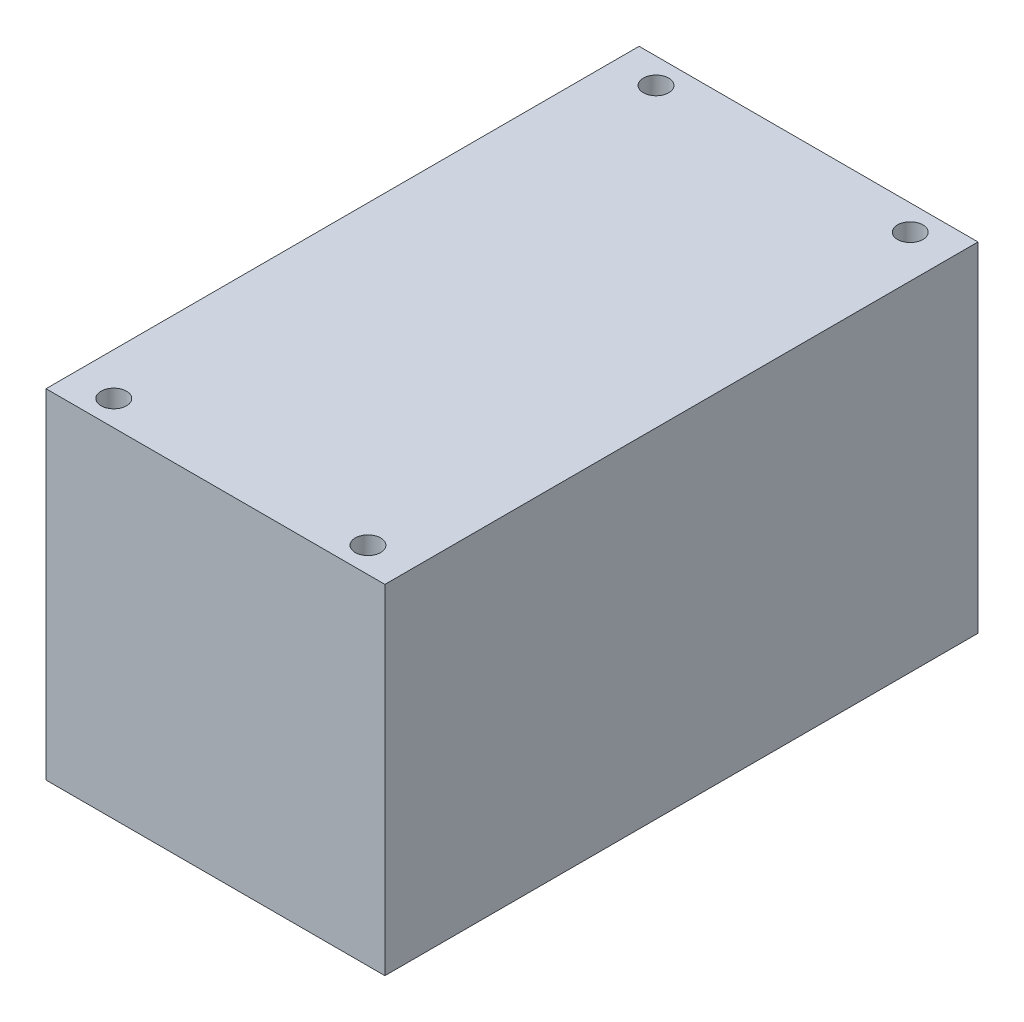
ISO-10303-21;
HEADER;
FILE_DESCRIPTION(('STEP AP214'),'2;1');
FILE_NAME('part.step','',(''),(''),'','','');
FILE_SCHEMA(('AUTOMOTIVE_DESIGN { 1 0 10303 214 1 1 1 1 }'));
ENDSEC;
DATA;
#1=APPLICATION_CONTEXT('core data for automotive mechanical design processes');
#2=APPLICATION_PROTOCOL_DEFINITION('international standard','automotive_design',2000,#1);
#3=PRODUCT_CONTEXT('',#1,'mechanical');
#4=PRODUCT('Part','Part','',(#3));
#5=PRODUCT_RELATED_PRODUCT_CATEGORY('part','',(#4));
#6=PRODUCT_DEFINITION_FORMATION('','',#4);
#7=PRODUCT_DEFINITION_CONTEXT('part definition',#1,'design');
#8=PRODUCT_DEFINITION('design','',#6,#7);
#9=PRODUCT_DEFINITION_SHAPE('','',#8);
#10=(LENGTH_UNIT() NAMED_UNIT(*) SI_UNIT(.MILLI.,.METRE.));
#11=(NAMED_UNIT(*) PLANE_ANGLE_UNIT() SI_UNIT($,.RADIAN.));
#12=(NAMED_UNIT(*) SI_UNIT($,.STERADIAN.) SOLID_ANGLE_UNIT());
#13=UNCERTAINTY_MEASURE_WITH_UNIT(LENGTH_MEASURE(1.E-05),#10,'distance_accuracy_value','');
#14=(GEOMETRIC_REPRESENTATION_CONTEXT(3) GLOBAL_UNCERTAINTY_ASSIGNED_CONTEXT((#13)) GLOBAL_UNIT_ASSIGNED_CONTEXT((#10,
#11,#12)) REPRESENTATION_CONTEXT('',''));
#15=CARTESIAN_POINT('',(0.,0.,0.));
#16=DIRECTION('',(0.,0.,1.));
#17=DIRECTION('',(1.,0.,0.));
#18=AXIS2_PLACEMENT_3D('',#15,#16,#17);
#19=CARTESIAN_POINT('',(-20.,-20.,-70.));
#20=DIRECTION('',(0.,-1.,0.));
#21=DIRECTION('',(0.,0.,-1.));
#22=AXIS2_PLACEMENT_3D('',#19,#20,#21);
#23=PLANE('',#22);
#24=CARTESIAN_POINT('',(-15.,-20.,-67.));
#25=DIRECTION('',(0.,1.,0.));
#26=DIRECTION('',(0.,0.,1.));
#27=AXIS2_PLACEMENT_3D('',#24,#25,#26);
#28=CIRCLE('',#27,1.49999999999999);
#29=CARTESIAN_POINT('',(-15.,-20.,-65.5));
#30=VERTEX_POINT('',#29);
#31=EDGE_CURVE('E138',#30,#30,#28,.T.);
#32=ORIENTED_EDGE('',*,*,#31,.T.);
#33=EDGE_LOOP('',(#32));
#34=FACE_BOUND('',#33,.T.);
#35=CARTESIAN_POINT('',(15.,-20.,-67.));
#36=DIRECTION('',(0.,1.,0.));
#37=DIRECTION('',(0.,0.,1.));
#38=AXIS2_PLACEMENT_3D('',#35,#36,#37);
#39=CIRCLE('',#38,1.49999999999999);
#40=CARTESIAN_POINT('',(15.,-20.,-65.5));
#41=VERTEX_POINT('',#40);
#42=EDGE_CURVE('E130',#41,#41,#39,.T.);
#43=ORIENTED_EDGE('',*,*,#42,.T.);
#44=EDGE_LOOP('',(#43));
#45=FACE_BOUND('',#44,.T.);
#46=DIRECTION('',(1.,0.,0.));
#47=VECTOR('',#46,1.);
#48=CARTESIAN_POINT('',(-20.,-20.,0.));
#49=LINE('',#48,#47);
#50=CARTESIAN_POINT('',(-20.,-20.,0.));
#51=VERTEX_POINT('',#50);
#52=CARTESIAN_POINT('',(20.,-20.,0.));
#53=VERTEX_POINT('',#52);
#54=EDGE_CURVE('E97',#51,#53,#49,.T.);
#55=ORIENTED_EDGE('',*,*,#54,.F.);
#56=DIRECTION('',(0.,0.,1.));
#57=VECTOR('',#56,1.);
#58=CARTESIAN_POINT('',(-20.,-20.,-70.));
#59=LINE('',#58,#57);
#60=CARTESIAN_POINT('',(-20.,-20.,-70.));
#61=VERTEX_POINT('',#60);
#62=EDGE_CURVE('E46',#61,#51,#59,.T.);
#63=ORIENTED_EDGE('',*,*,#62,.F.);
#64=DIRECTION('',(1.,0.,0.));
#65=VECTOR('',#64,1.);
#66=CARTESIAN_POINT('',(-20.,-20.,-70.));
#67=LINE('',#66,#65);
#68=CARTESIAN_POINT('',(20.,-20.,-70.));
#69=VERTEX_POINT('',#68);
#70=EDGE_CURVE('E92',#61,#69,#67,.T.);
#71=ORIENTED_EDGE('',*,*,#70,.T.);
#72=DIRECTION('',(0.,0.,1.));
#73=VECTOR('',#72,1.);
#74=CARTESIAN_POINT('',(20.,-20.,-70.));
#75=LINE('',#74,#73);
#76=EDGE_CURVE('E11',#69,#53,#75,.T.);
#77=ORIENTED_EDGE('',*,*,#76,.T.);
#78=EDGE_LOOP('',(#55,#63,#71,#77));
#79=FACE_BOUND('',#78,.T.);
#80=CARTESIAN_POINT('',(15.,-20.,-3.00000000000002));
#81=DIRECTION('',(0.,1.,0.));
#82=DIRECTION('',(0.,0.,1.));
#83=AXIS2_PLACEMENT_3D('',#80,#81,#82);
#84=CIRCLE('',#83,1.49999999999999);
#85=CARTESIAN_POINT('',(15.,-20.,-1.50000000000002));
#86=VERTEX_POINT('',#85);
#87=EDGE_CURVE('E106',#86,#86,#84,.T.);
#88=ORIENTED_EDGE('',*,*,#87,.T.);
#89=EDGE_LOOP('',(#88));
#90=FACE_BOUND('',#89,.T.);
#91=CARTESIAN_POINT('',(-15.,-20.,-3.00000000000002));
#92=DIRECTION('',(0.,1.,0.));
#93=DIRECTION('',(0.,0.,1.));
#94=AXIS2_PLACEMENT_3D('',#91,#92,#93);
#95=CIRCLE('',#94,1.49999999999999);
#96=CARTESIAN_POINT('',(-15.,-20.,-1.50000000000003));
#97=VERTEX_POINT('',#96);
#98=EDGE_CURVE('E122',#97,#97,#95,.T.);
#99=ORIENTED_EDGE('',*,*,#98,.T.);
#100=EDGE_LOOP('',(#99));
#101=FACE_BOUND('',#100,.T.);
#102=ADVANCED_FACE('F36',(#34,#45,#79,#90,#101),#23,.T.);
#103=CARTESIAN_POINT('',(20.,20.,-70.));
#104=DIRECTION('',(1.,0.,0.));
#105=DIRECTION('',(0.,1.,0.));
#106=AXIS2_PLACEMENT_3D('',#103,#104,#105);
#107=PLANE('',#106);
#108=DIRECTION('',(0.,1.,0.));
#109=VECTOR('',#108,1.);
#110=CARTESIAN_POINT('',(20.,20.,0.));
#111=LINE('',#110,#109);
#112=CARTESIAN_POINT('',(20.,20.,0.));
#113=VERTEX_POINT('',#112);
#114=EDGE_CURVE('E102',#53,#113,#111,.T.);
#115=ORIENTED_EDGE('',*,*,#114,.F.);
#116=ORIENTED_EDGE('',*,*,#76,.F.);
#117=DIRECTION('',(0.,1.,0.));
#118=VECTOR('',#117,1.);
#119=CARTESIAN_POINT('',(20.,20.,-70.));
#120=LINE('',#119,#118);
#121=CARTESIAN_POINT('',(20.,20.,-70.));
#122=VERTEX_POINT('',#121);
#123=EDGE_CURVE('E95',#69,#122,#120,.T.);
#124=ORIENTED_EDGE('',*,*,#123,.T.);
#125=DIRECTION('',(0.,0.,1.));
#126=VECTOR('',#125,1.);
#127=CARTESIAN_POINT('',(20.,20.,-70.));
#128=LINE('',#127,#126);
#129=EDGE_CURVE('E40',#122,#113,#128,.T.);
#130=ORIENTED_EDGE('',*,*,#129,.T.);
#131=EDGE_LOOP('',(#115,#116,#124,#130));
#132=FACE_BOUND('',#131,.T.);
#133=ADVANCED_FACE('F38',(#132),#107,.T.);
#134=CARTESIAN_POINT('',(-20.,20.,-70.));
#135=DIRECTION('',(-1.,0.,0.));
#136=DIRECTION('',(0.,-1.,0.));
#137=AXIS2_PLACEMENT_3D('',#134,#135,#136);
#138=PLANE('',#137);
#139=DIRECTION('',(0.,-1.,0.));
#140=VECTOR('',#139,1.);
#141=CARTESIAN_POINT('',(-20.,20.,0.));
#142=LINE('',#141,#140);
#143=CARTESIAN_POINT('',(-20.,20.,0.));
#144=VERTEX_POINT('',#143);
#145=EDGE_CURVE('E87',#144,#51,#142,.T.);
#146=ORIENTED_EDGE('',*,*,#145,.F.);
#147=DIRECTION('',(0.,0.,1.));
#148=VECTOR('',#147,1.);
#149=CARTESIAN_POINT('',(-20.,20.,-70.));
#150=LINE('',#149,#148);
#151=CARTESIAN_POINT('',(-20.,20.,-70.));
#152=VERTEX_POINT('',#151);
#153=EDGE_CURVE('E82',#152,#144,#150,.T.);
#154=ORIENTED_EDGE('',*,*,#153,.F.);
#155=DIRECTION('',(0.,-1.,0.));
#156=VECTOR('',#155,1.);
#157=CARTESIAN_POINT('',(-20.,20.,-70.));
#158=LINE('',#157,#156);
#159=EDGE_CURVE('E85',#152,#61,#158,.T.);
#160=ORIENTED_EDGE('',*,*,#159,.T.);
#161=ORIENTED_EDGE('',*,*,#62,.T.);
#162=EDGE_LOOP('',(#146,#154,#160,#161));
#163=FACE_BOUND('',#162,.T.);
#164=ADVANCED_FACE('F84',(#163),#138,.T.);
#165=CARTESIAN_POINT('',(-20.,20.,-70.));
#166=DIRECTION('',(0.,1.,0.));
#167=DIRECTION('',(0.,0.,1.));
#168=AXIS2_PLACEMENT_3D('',#165,#166,#167);
#169=PLANE('',#168);
#170=CARTESIAN_POINT('',(-15.,20.,-67.));
#171=DIRECTION('',(0.,1.,0.));
#172=DIRECTION('',(0.,0.,1.));
#173=AXIS2_PLACEMENT_3D('',#170,#171,#172);
#174=CIRCLE('',#173,1.5);
#175=CARTESIAN_POINT('',(-15.,20.,-65.5));
#176=VERTEX_POINT('',#175);
#177=EDGE_CURVE('E141',#176,#176,#174,.T.);
#178=ORIENTED_EDGE('',*,*,#177,.F.);
#179=EDGE_LOOP('',(#178));
#180=FACE_BOUND('',#179,.T.);
#181=CARTESIAN_POINT('',(15.,20.,-67.));
#182=DIRECTION('',(0.,1.,0.));
#183=DIRECTION('',(0.,0.,1.));
#184=AXIS2_PLACEMENT_3D('',#181,#182,#183);
#185=CIRCLE('',#184,1.5);
#186=CARTESIAN_POINT('',(15.,20.,-65.5));
#187=VERTEX_POINT('',#186);
#188=EDGE_CURVE('E135',#187,#187,#185,.T.);
#189=ORIENTED_EDGE('',*,*,#188,.F.);
#190=EDGE_LOOP('',(#189));
#191=FACE_BOUND('',#190,.T.);
#192=CARTESIAN_POINT('',(-15.,20.,-3.00000000000002));
#193=DIRECTION('',(0.,1.,0.));
#194=DIRECTION('',(0.,0.,1.));
#195=AXIS2_PLACEMENT_3D('',#192,#193,#194);
#196=CIRCLE('',#195,1.5);
#197=CARTESIAN_POINT('',(-15.,20.,-1.50000000000002));
#198=VERTEX_POINT('',#197);
#199=EDGE_CURVE('E125',#198,#198,#196,.T.);
#200=ORIENTED_EDGE('',*,*,#199,.F.);
#201=EDGE_LOOP('',(#200));
#202=FACE_BOUND('',#201,.T.);
#203=CARTESIAN_POINT('',(15.,20.,-3.00000000000002));
#204=DIRECTION('',(0.,1.,0.));
#205=DIRECTION('',(0.,0.,1.));
#206=AXIS2_PLACEMENT_3D('',#203,#204,#205);
#207=CIRCLE('',#206,1.5);
#208=CARTESIAN_POINT('',(15.,20.,-1.50000000000002));
#209=VERTEX_POINT('',#208);
#210=EDGE_CURVE('E124',#209,#209,#207,.T.);
#211=ORIENTED_EDGE('',*,*,#210,.F.);
#212=EDGE_LOOP('',(#211));
#213=FACE_BOUND('',#212,.T.);
#214=DIRECTION('',(-1.,0.,0.));
#215=VECTOR('',#214,1.);
#216=CARTESIAN_POINT('',(-20.,20.,0.));
#217=LINE('',#216,#215);
#218=EDGE_CURVE('E105',#113,#144,#217,.T.);
#219=ORIENTED_EDGE('',*,*,#218,.F.);
#220=ORIENTED_EDGE('',*,*,#129,.F.);
#221=DIRECTION('',(-1.,0.,0.));
#222=VECTOR('',#221,1.);
#223=CARTESIAN_POINT('',(-20.,20.,-70.));
#224=LINE('',#223,#222);
#225=EDGE_CURVE('E91',#122,#152,#224,.T.);
#226=ORIENTED_EDGE('',*,*,#225,.T.);
#227=ORIENTED_EDGE('',*,*,#153,.T.);
#228=EDGE_LOOP('',(#219,#220,#226,#227));
#229=FACE_BOUND('',#228,.T.);
#230=ADVANCED_FACE('F94',(#180,#191,#202,#213,#229),#169,.T.);
#231=CARTESIAN_POINT('',(0.,0.,-70.));
#232=DIRECTION('',(0.,0.,1.));
#233=DIRECTION('',(1.,0.,0.));
#234=AXIS2_PLACEMENT_3D('',#231,#232,#233);
#235=PLANE('',#234);
#236=ORIENTED_EDGE('',*,*,#123,.F.);
#237=ORIENTED_EDGE('',*,*,#70,.F.);
#238=ORIENTED_EDGE('',*,*,#159,.F.);
#239=ORIENTED_EDGE('',*,*,#225,.F.);
#240=EDGE_LOOP('',(#236,#237,#238,#239));
#241=FACE_BOUND('',#240,.T.);
#242=ADVANCED_FACE('F90',(#241),#235,.F.);
#243=CARTESIAN_POINT('',(0.,0.,0.));
#244=DIRECTION('',(0.,0.,1.));
#245=DIRECTION('',(1.,0.,0.));
#246=AXIS2_PLACEMENT_3D('',#243,#244,#245);
#247=PLANE('',#246);
#248=ORIENTED_EDGE('',*,*,#114,.T.);
#249=ORIENTED_EDGE('',*,*,#218,.T.);
#250=ORIENTED_EDGE('',*,*,#145,.T.);
#251=ORIENTED_EDGE('',*,*,#54,.T.);
#252=EDGE_LOOP('',(#248,#249,#250,#251));
#253=FACE_BOUND('',#252,.T.);
#254=ADVANCED_FACE('F112',(#253),#247,.T.);
#255=CARTESIAN_POINT('',(15.,20.,-3.00000000000002));
#256=DIRECTION('',(0.,1.,0.));
#257=DIRECTION('',(0.,0.,1.));
#258=AXIS2_PLACEMENT_3D('',#255,#256,#257);
#259=CYLINDRICAL_SURFACE('',#258,1.5);
#260=ORIENTED_EDGE('',*,*,#87,.F.);
#261=EDGE_LOOP('',(#260));
#262=FACE_BOUND('',#261,.T.);
#263=ORIENTED_EDGE('',*,*,#210,.T.);
#264=EDGE_LOOP('',(#263));
#265=FACE_BOUND('',#264,.T.);
#266=ADVANCED_FACE('F155',(#262,#265),#259,.F.);
#267=CARTESIAN_POINT('',(-15.,20.,-3.00000000000002));
#268=DIRECTION('',(0.,1.,0.));
#269=DIRECTION('',(0.,0.,1.));
#270=AXIS2_PLACEMENT_3D('',#267,#268,#269);
#271=CYLINDRICAL_SURFACE('',#270,1.5);
#272=ORIENTED_EDGE('',*,*,#98,.F.);
#273=EDGE_LOOP('',(#272));
#274=FACE_BOUND('',#273,.T.);
#275=ORIENTED_EDGE('',*,*,#199,.T.);
#276=EDGE_LOOP('',(#275));
#277=FACE_BOUND('',#276,.T.);
#278=ADVANCED_FACE('F157',(#274,#277),#271,.F.);
#279=CARTESIAN_POINT('',(15.,20.,-67.));
#280=DIRECTION('',(0.,1.,0.));
#281=DIRECTION('',(0.,0.,1.));
#282=AXIS2_PLACEMENT_3D('',#279,#280,#281);
#283=CYLINDRICAL_SURFACE('',#282,1.5);
#284=ORIENTED_EDGE('',*,*,#42,.F.);
#285=EDGE_LOOP('',(#284));
#286=FACE_BOUND('',#285,.T.);
#287=ORIENTED_EDGE('',*,*,#188,.T.);
#288=EDGE_LOOP('',(#287));
#289=FACE_BOUND('',#288,.T.);
#290=ADVANCED_FACE('F164',(#286,#289),#283,.F.);
#291=CARTESIAN_POINT('',(-15.,20.,-67.));
#292=DIRECTION('',(0.,1.,0.));
#293=DIRECTION('',(0.,0.,1.));
#294=AXIS2_PLACEMENT_3D('',#291,#292,#293);
#295=CYLINDRICAL_SURFACE('',#294,1.5);
#296=ORIENTED_EDGE('',*,*,#31,.F.);
#297=EDGE_LOOP('',(#296));
#298=FACE_BOUND('',#297,.T.);
#299=ORIENTED_EDGE('',*,*,#177,.T.);
#300=EDGE_LOOP('',(#299));
#301=FACE_BOUND('',#300,.T.);
#302=ADVANCED_FACE('F145',(#298,#301),#295,.F.);
#303=CLOSED_SHELL('',(#102,#133,#164,#230,#242,#254,#266,#278,#290,#302));
#304=MANIFOLD_SOLID_BREP('B2',#303);
#305=ADVANCED_BREP_SHAPE_REPRESENTATION('',(#18,#304),#14);
#306=SHAPE_DEFINITION_REPRESENTATION(#9,#305);
ENDSEC;
END-ISO-10303-21;
